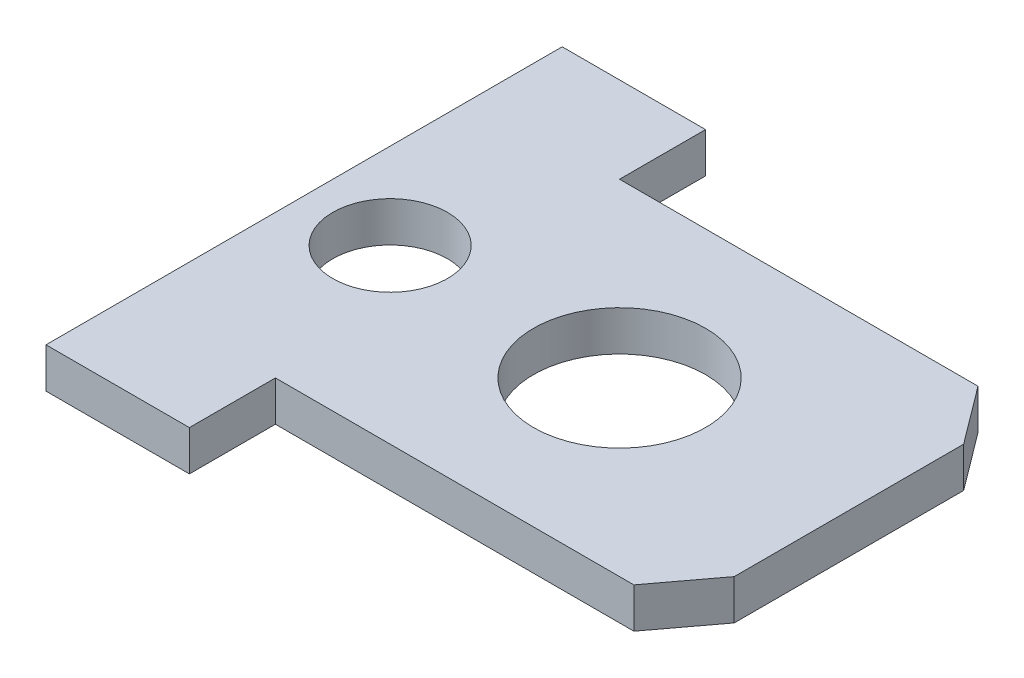
ISO-10303-21;
HEADER;
FILE_DESCRIPTION(('STEP AP214'),'2;1');
FILE_NAME('part.step','',(''),(''),'','','');
FILE_SCHEMA(('AUTOMOTIVE_DESIGN { 1 0 10303 214 1 1 1 1 }'));
ENDSEC;
DATA;
#1=APPLICATION_CONTEXT('core data for automotive mechanical design processes');
#2=APPLICATION_PROTOCOL_DEFINITION('international standard','automotive_design',2000,#1);
#3=PRODUCT_CONTEXT('',#1,'mechanical');
#4=PRODUCT('Part','Part','',(#3));
#5=PRODUCT_RELATED_PRODUCT_CATEGORY('part','',(#4));
#6=PRODUCT_DEFINITION_FORMATION('','',#4);
#7=PRODUCT_DEFINITION_CONTEXT('part definition',#1,'design');
#8=PRODUCT_DEFINITION('design','',#6,#7);
#9=PRODUCT_DEFINITION_SHAPE('','',#8);
#10=(LENGTH_UNIT() NAMED_UNIT(*) SI_UNIT(.MILLI.,.METRE.));
#11=(NAMED_UNIT(*) PLANE_ANGLE_UNIT() SI_UNIT($,.RADIAN.));
#12=(NAMED_UNIT(*) SI_UNIT($,.STERADIAN.) SOLID_ANGLE_UNIT());
#13=UNCERTAINTY_MEASURE_WITH_UNIT(LENGTH_MEASURE(1.E-05),#10,'distance_accuracy_value','');
#14=(GEOMETRIC_REPRESENTATION_CONTEXT(3) GLOBAL_UNCERTAINTY_ASSIGNED_CONTEXT((#13)) GLOBAL_UNIT_ASSIGNED_CONTEXT((#10,
#11,#12)) REPRESENTATION_CONTEXT('',''));
#15=CARTESIAN_POINT('',(0.,0.,0.));
#16=DIRECTION('',(0.,0.,1.));
#17=DIRECTION('',(1.,0.,0.));
#18=AXIS2_PLACEMENT_3D('',#15,#16,#17);
#19=CARTESIAN_POINT('',(16.,91.15,112.5));
#20=DIRECTION('',(0.,-1.,0.));
#21=DIRECTION('',(0.,0.,-1.));
#22=AXIS2_PLACEMENT_3D('',#19,#20,#21);
#23=PLANE('',#22);
#24=CARTESIAN_POINT('',(21.5,91.15,112.5));
#25=DIRECTION('',(0.,-1.,0.));
#26=DIRECTION('',(0.,0.,-1.));
#27=AXIS2_PLACEMENT_3D('',#24,#25,#26);
#28=CIRCLE('',#27,1.5);
#29=CARTESIAN_POINT('',(21.5,91.15,111.));
#30=VERTEX_POINT('',#29);
#31=EDGE_CURVE('E121',#30,#30,#28,.F.);
#32=ORIENTED_EDGE('',*,*,#31,.T.);
#33=EDGE_LOOP('',(#32));
#34=FACE_BOUND('',#33,.T.);
#35=CARTESIAN_POINT('',(17.5,91.15,112.5));
#36=DIRECTION('',(0.,-1.,0.));
#37=DIRECTION('',(0.,0.,-1.));
#38=AXIS2_PLACEMENT_3D('',#35,#36,#37);
#39=CIRCLE('',#38,1.);
#40=CARTESIAN_POINT('',(17.5,91.15,111.5));
#41=VERTEX_POINT('',#40);
#42=EDGE_CURVE('E20',#41,#41,#39,.F.);
#43=ORIENTED_EDGE('',*,*,#42,.T.);
#44=EDGE_LOOP('',(#43));
#45=FACE_BOUND('',#44,.T.);
#46=DIRECTION('',(-1.,0.,0.));
#47=VECTOR('',#46,1.);
#48=CARTESIAN_POINT('',(16.,91.15,108.));
#49=LINE('',#48,#47);
#50=CARTESIAN_POINT('',(18.5,91.15,108.));
#51=VERTEX_POINT('',#50);
#52=CARTESIAN_POINT('',(16.,91.15,108.));
#53=VERTEX_POINT('',#52);
#54=EDGE_CURVE('E152',#51,#53,#49,.T.);
#55=ORIENTED_EDGE('',*,*,#54,.F.);
#56=DIRECTION('',(0.,0.,-1.));
#57=VECTOR('',#56,1.);
#58=CARTESIAN_POINT('',(18.5,91.15,112.));
#59=LINE('',#58,#57);
#60=CARTESIAN_POINT('',(18.5,91.15,109.5));
#61=VERTEX_POINT('',#60);
#62=EDGE_CURVE('E157',#61,#51,#59,.T.);
#63=ORIENTED_EDGE('',*,*,#62,.F.);
#64=DIRECTION('',(-1.,0.,0.));
#65=VECTOR('',#64,1.);
#66=CARTESIAN_POINT('',(16.,91.15,109.5));
#67=LINE('',#66,#65);
#68=CARTESIAN_POINT('',(24.75,91.15,109.5));
#69=VERTEX_POINT('',#68);
#70=EDGE_CURVE('E162',#69,#61,#67,.T.);
#71=ORIENTED_EDGE('',*,*,#70,.F.);
#72=DIRECTION('',(-0.6,0.,-0.8));
#73=VECTOR('',#72,1.);
#74=CARTESIAN_POINT('',(25.125,91.15,110.));
#75=LINE('',#74,#73);
#76=CARTESIAN_POINT('',(25.5,91.15,110.5));
#77=VERTEX_POINT('',#76);
#78=EDGE_CURVE('E108',#77,#69,#75,.T.);
#79=ORIENTED_EDGE('',*,*,#78,.F.);
#80=DIRECTION('',(0.,0.,-1.));
#81=VECTOR('',#80,1.);
#82=CARTESIAN_POINT('',(25.5,91.15,112.));
#83=LINE('',#82,#81);
#84=CARTESIAN_POINT('',(25.5,91.15,114.5));
#85=VERTEX_POINT('',#84);
#86=EDGE_CURVE('E91',#85,#77,#83,.T.);
#87=ORIENTED_EDGE('',*,*,#86,.F.);
#88=DIRECTION('',(0.6,0.,-0.8));
#89=VECTOR('',#88,1.);
#90=CARTESIAN_POINT('',(25.125,91.15,115.));
#91=LINE('',#90,#89);
#92=CARTESIAN_POINT('',(24.75,91.15,115.5));
#93=VERTEX_POINT('',#92);
#94=EDGE_CURVE('E96',#93,#85,#91,.T.);
#95=ORIENTED_EDGE('',*,*,#94,.F.);
#96=DIRECTION('',(1.,0.,0.));
#97=VECTOR('',#96,1.);
#98=CARTESIAN_POINT('',(16.,91.15,115.5));
#99=LINE('',#98,#97);
#100=CARTESIAN_POINT('',(18.5,91.15,115.5));
#101=VERTEX_POINT('',#100);
#102=EDGE_CURVE('E128',#101,#93,#99,.T.);
#103=ORIENTED_EDGE('',*,*,#102,.F.);
#104=DIRECTION('',(0.,0.,-1.));
#105=VECTOR('',#104,1.);
#106=CARTESIAN_POINT('',(18.5,91.15,112.));
#107=LINE('',#106,#105);
#108=CARTESIAN_POINT('',(18.5,91.15,117.));
#109=VERTEX_POINT('',#108);
#110=EDGE_CURVE('E137',#109,#101,#107,.T.);
#111=ORIENTED_EDGE('',*,*,#110,.F.);
#112=DIRECTION('',(1.,0.,0.));
#113=VECTOR('',#112,1.);
#114=CARTESIAN_POINT('',(16.,91.15,117.));
#115=LINE('',#114,#113);
#116=CARTESIAN_POINT('',(16.,91.15,117.));
#117=VERTEX_POINT('',#116);
#118=EDGE_CURVE('E142',#117,#109,#115,.T.);
#119=ORIENTED_EDGE('',*,*,#118,.F.);
#120=DIRECTION('',(0.,0.,-1.));
#121=VECTOR('',#120,1.);
#122=CARTESIAN_POINT('',(16.,91.15,112.));
#123=LINE('',#122,#121);
#124=EDGE_CURVE('E147',#117,#53,#123,.T.);
#125=ORIENTED_EDGE('',*,*,#124,.T.);
#126=EDGE_LOOP('',(#55,#63,#71,#79,#87,#95,#103,#111,#119,#125));
#127=FACE_BOUND('',#126,.T.);
#128=ADVANCED_FACE('F17',(#34,#45,#127),#23,.T.);
#129=CARTESIAN_POINT('',(25.125,91.15,115.));
#130=DIRECTION('',(0.8,0.,0.6));
#131=DIRECTION('',(0.6,0.,-0.8));
#132=AXIS2_PLACEMENT_3D('',#129,#130,#131);
#133=PLANE('',#132);
#134=ORIENTED_EDGE('',*,*,#94,.T.);
#135=DIRECTION('',(0.,1.,0.));
#136=VECTOR('',#135,1.);
#137=CARTESIAN_POINT('',(25.5,91.5,114.5));
#138=LINE('',#137,#136);
#139=CARTESIAN_POINT('',(25.5,91.85,114.5));
#140=VERTEX_POINT('',#139);
#141=EDGE_CURVE('E98',#140,#85,#138,.F.);
#142=ORIENTED_EDGE('',*,*,#141,.F.);
#143=DIRECTION('',(0.6,0.,-0.8));
#144=VECTOR('',#143,1.);
#145=CARTESIAN_POINT('',(24.75,91.85,115.5));
#146=LINE('',#145,#144);
#147=CARTESIAN_POINT('',(24.75,91.85,115.5));
#148=VERTEX_POINT('',#147);
#149=EDGE_CURVE('E123',#148,#140,#146,.T.);
#150=ORIENTED_EDGE('',*,*,#149,.F.);
#151=DIRECTION('',(0.,1.,0.));
#152=VECTOR('',#151,1.);
#153=CARTESIAN_POINT('',(24.75,91.5,115.5));
#154=LINE('',#153,#152);
#155=EDGE_CURVE('E101',#93,#148,#154,.T.);
#156=ORIENTED_EDGE('',*,*,#155,.F.);
#157=EDGE_LOOP('',(#134,#142,#150,#156));
#158=FACE_BOUND('',#157,.T.);
#159=ADVANCED_FACE('F97',(#158),#133,.T.);
#160=CARTESIAN_POINT('',(25.5,91.5,112.));
#161=DIRECTION('',(1.,0.,0.));
#162=DIRECTION('',(0.,0.,-1.));
#163=AXIS2_PLACEMENT_3D('',#160,#161,#162);
#164=PLANE('',#163);
#165=ORIENTED_EDGE('',*,*,#141,.T.);
#166=ORIENTED_EDGE('',*,*,#86,.T.);
#167=DIRECTION('',(0.,1.,0.));
#168=VECTOR('',#167,1.);
#169=CARTESIAN_POINT('',(25.5,91.15,110.5));
#170=LINE('',#169,#168);
#171=CARTESIAN_POINT('',(25.5,91.85,110.5));
#172=VERTEX_POINT('',#171);
#173=EDGE_CURVE('E110',#172,#77,#170,.F.);
#174=ORIENTED_EDGE('',*,*,#173,.F.);
#175=DIRECTION('',(0.,0.,1.));
#176=VECTOR('',#175,1.);
#177=CARTESIAN_POINT('',(25.5,91.85,112.5));
#178=LINE('',#177,#176);
#179=EDGE_CURVE('E114',#140,#172,#178,.F.);
#180=ORIENTED_EDGE('',*,*,#179,.F.);
#181=EDGE_LOOP('',(#165,#166,#174,#180));
#182=FACE_BOUND('',#181,.T.);
#183=ADVANCED_FACE('F112',(#182),#164,.T.);
#184=CARTESIAN_POINT('',(25.125,91.15,110.));
#185=DIRECTION('',(0.8,0.,-0.6));
#186=DIRECTION('',(-0.6,0.,-0.8));
#187=AXIS2_PLACEMENT_3D('',#184,#185,#186);
#188=PLANE('',#187);
#189=ORIENTED_EDGE('',*,*,#78,.T.);
#190=DIRECTION('',(0.,1.,0.));
#191=VECTOR('',#190,1.);
#192=CARTESIAN_POINT('',(24.75,91.5,109.5));
#193=LINE('',#192,#191);
#194=CARTESIAN_POINT('',(24.75,91.85,109.5));
#195=VERTEX_POINT('',#194);
#196=EDGE_CURVE('E164',#195,#69,#193,.F.);
#197=ORIENTED_EDGE('',*,*,#196,.F.);
#198=DIRECTION('',(-0.6,0.,-0.8));
#199=VECTOR('',#198,1.);
#200=CARTESIAN_POINT('',(25.5,91.85,110.5));
#201=LINE('',#200,#199);
#202=EDGE_CURVE('E171',#172,#195,#201,.T.);
#203=ORIENTED_EDGE('',*,*,#202,.F.);
#204=ORIENTED_EDGE('',*,*,#173,.T.);
#205=EDGE_LOOP('',(#189,#197,#203,#204));
#206=FACE_BOUND('',#205,.T.);
#207=ADVANCED_FACE('F169',(#206),#188,.T.);
#208=CARTESIAN_POINT('',(16.,91.5,109.5));
#209=DIRECTION('',(0.,0.,-1.));
#210=DIRECTION('',(-1.,0.,0.));
#211=AXIS2_PLACEMENT_3D('',#208,#209,#210);
#212=PLANE('',#211);
#213=ORIENTED_EDGE('',*,*,#70,.T.);
#214=DIRECTION('',(0.,1.,0.));
#215=VECTOR('',#214,1.);
#216=CARTESIAN_POINT('',(18.5,91.5,109.5));
#217=LINE('',#216,#215);
#218=CARTESIAN_POINT('',(18.5,91.85,109.5));
#219=VERTEX_POINT('',#218);
#220=EDGE_CURVE('E159',#219,#61,#217,.F.);
#221=ORIENTED_EDGE('',*,*,#220,.F.);
#222=DIRECTION('',(1.,0.,0.));
#223=VECTOR('',#222,1.);
#224=CARTESIAN_POINT('',(16.,91.85,109.5));
#225=LINE('',#224,#223);
#226=EDGE_CURVE('E175',#195,#219,#225,.F.);
#227=ORIENTED_EDGE('',*,*,#226,.F.);
#228=ORIENTED_EDGE('',*,*,#196,.T.);
#229=EDGE_LOOP('',(#213,#221,#227,#228));
#230=FACE_BOUND('',#229,.T.);
#231=ADVANCED_FACE('F284',(#230),#212,.T.);
#232=CARTESIAN_POINT('',(18.5,91.5,112.));
#233=DIRECTION('',(1.,0.,0.));
#234=DIRECTION('',(0.,0.,-1.));
#235=AXIS2_PLACEMENT_3D('',#232,#233,#234);
#236=PLANE('',#235);
#237=ORIENTED_EDGE('',*,*,#220,.T.);
#238=ORIENTED_EDGE('',*,*,#62,.T.);
#239=DIRECTION('',(0.,1.,0.));
#240=VECTOR('',#239,1.);
#241=CARTESIAN_POINT('',(18.5,91.5,108.));
#242=LINE('',#241,#240);
#243=CARTESIAN_POINT('',(18.5,91.85,108.));
#244=VERTEX_POINT('',#243);
#245=EDGE_CURVE('E154',#244,#51,#242,.F.);
#246=ORIENTED_EDGE('',*,*,#245,.F.);
#247=DIRECTION('',(0.,0.,1.));
#248=VECTOR('',#247,1.);
#249=CARTESIAN_POINT('',(18.5,91.85,112.5));
#250=LINE('',#249,#248);
#251=EDGE_CURVE('E182',#219,#244,#250,.F.);
#252=ORIENTED_EDGE('',*,*,#251,.F.);
#253=EDGE_LOOP('',(#237,#238,#246,#252));
#254=FACE_BOUND('',#253,.T.);
#255=ADVANCED_FACE('F274',(#254),#236,.T.);
#256=CARTESIAN_POINT('',(16.,91.5,108.));
#257=DIRECTION('',(0.,0.,-1.));
#258=DIRECTION('',(-1.,0.,0.));
#259=AXIS2_PLACEMENT_3D('',#256,#257,#258);
#260=PLANE('',#259);
#261=ORIENTED_EDGE('',*,*,#245,.T.);
#262=ORIENTED_EDGE('',*,*,#54,.T.);
#263=DIRECTION('',(0.,1.,0.));
#264=VECTOR('',#263,1.);
#265=CARTESIAN_POINT('',(16.,91.5,108.));
#266=LINE('',#265,#264);
#267=CARTESIAN_POINT('',(16.,91.85,108.));
#268=VERTEX_POINT('',#267);
#269=EDGE_CURVE('E150',#53,#268,#266,.T.);
#270=ORIENTED_EDGE('',*,*,#269,.T.);
#271=DIRECTION('',(1.,0.,0.));
#272=VECTOR('',#271,1.);
#273=CARTESIAN_POINT('',(16.,91.85,108.));
#274=LINE('',#273,#272);
#275=EDGE_CURVE('E185',#244,#268,#274,.F.);
#276=ORIENTED_EDGE('',*,*,#275,.F.);
#277=EDGE_LOOP('',(#261,#262,#270,#276));
#278=FACE_BOUND('',#277,.T.);
#279=ADVANCED_FACE('F264',(#278),#260,.T.);
#280=CARTESIAN_POINT('',(16.,91.5,112.));
#281=DIRECTION('',(1.,0.,0.));
#282=DIRECTION('',(0.,0.,-1.));
#283=AXIS2_PLACEMENT_3D('',#280,#281,#282);
#284=PLANE('',#283);
#285=DIRECTION('',(0.,1.,0.));
#286=VECTOR('',#285,1.);
#287=CARTESIAN_POINT('',(16.,91.5,117.));
#288=LINE('',#287,#286);
#289=CARTESIAN_POINT('',(16.,91.85,117.));
#290=VERTEX_POINT('',#289);
#291=EDGE_CURVE('E144',#290,#117,#288,.F.);
#292=ORIENTED_EDGE('',*,*,#291,.F.);
#293=DIRECTION('',(0.,0.,1.));
#294=VECTOR('',#293,1.);
#295=CARTESIAN_POINT('',(16.,91.85,112.5));
#296=LINE('',#295,#294);
#297=EDGE_CURVE('E188',#268,#290,#296,.T.);
#298=ORIENTED_EDGE('',*,*,#297,.F.);
#299=ORIENTED_EDGE('',*,*,#269,.F.);
#300=ORIENTED_EDGE('',*,*,#124,.F.);
#301=EDGE_LOOP('',(#292,#298,#299,#300));
#302=FACE_BOUND('',#301,.T.);
#303=ADVANCED_FACE('F254',(#302),#284,.F.);
#304=CARTESIAN_POINT('',(16.,91.5,117.));
#305=DIRECTION('',(0.,0.,1.));
#306=DIRECTION('',(1.,0.,0.));
#307=AXIS2_PLACEMENT_3D('',#304,#305,#306);
#308=PLANE('',#307);
#309=ORIENTED_EDGE('',*,*,#291,.T.);
#310=ORIENTED_EDGE('',*,*,#118,.T.);
#311=DIRECTION('',(0.,1.,0.));
#312=VECTOR('',#311,1.);
#313=CARTESIAN_POINT('',(18.5,91.5,117.));
#314=LINE('',#313,#312);
#315=CARTESIAN_POINT('',(18.5,91.85,117.));
#316=VERTEX_POINT('',#315);
#317=EDGE_CURVE('E139',#316,#109,#314,.F.);
#318=ORIENTED_EDGE('',*,*,#317,.F.);
#319=DIRECTION('',(1.,0.,0.));
#320=VECTOR('',#319,1.);
#321=CARTESIAN_POINT('',(16.,91.85,117.));
#322=LINE('',#321,#320);
#323=EDGE_CURVE('E191',#290,#316,#322,.T.);
#324=ORIENTED_EDGE('',*,*,#323,.F.);
#325=EDGE_LOOP('',(#309,#310,#318,#324));
#326=FACE_BOUND('',#325,.T.);
#327=ADVANCED_FACE('F209',(#326),#308,.T.);
#328=CARTESIAN_POINT('',(18.5,91.5,112.));
#329=DIRECTION('',(1.,0.,0.));
#330=DIRECTION('',(0.,0.,-1.));
#331=AXIS2_PLACEMENT_3D('',#328,#329,#330);
#332=PLANE('',#331);
#333=ORIENTED_EDGE('',*,*,#110,.T.);
#334=DIRECTION('',(0.,1.,0.));
#335=VECTOR('',#334,1.);
#336=CARTESIAN_POINT('',(18.5,91.5,115.5));
#337=LINE('',#336,#335);
#338=CARTESIAN_POINT('',(18.5,91.85,115.5));
#339=VERTEX_POINT('',#338);
#340=EDGE_CURVE('E35',#339,#101,#337,.F.);
#341=ORIENTED_EDGE('',*,*,#340,.F.);
#342=DIRECTION('',(0.,0.,1.));
#343=VECTOR('',#342,1.);
#344=CARTESIAN_POINT('',(18.5,91.85,112.5));
#345=LINE('',#344,#343);
#346=EDGE_CURVE('E194',#316,#339,#345,.F.);
#347=ORIENTED_EDGE('',*,*,#346,.F.);
#348=ORIENTED_EDGE('',*,*,#317,.T.);
#349=EDGE_LOOP('',(#333,#341,#347,#348));
#350=FACE_BOUND('',#349,.T.);
#351=ADVANCED_FACE('F199',(#350),#332,.T.);
#352=CARTESIAN_POINT('',(16.,91.5,115.5));
#353=DIRECTION('',(0.,0.,1.));
#354=DIRECTION('',(1.,0.,0.));
#355=AXIS2_PLACEMENT_3D('',#352,#353,#354);
#356=PLANE('',#355);
#357=ORIENTED_EDGE('',*,*,#340,.T.);
#358=ORIENTED_EDGE('',*,*,#102,.T.);
#359=ORIENTED_EDGE('',*,*,#155,.T.);
#360=DIRECTION('',(1.,0.,0.));
#361=VECTOR('',#360,1.);
#362=CARTESIAN_POINT('',(16.,91.85,115.5));
#363=LINE('',#362,#361);
#364=EDGE_CURVE('E120',#339,#148,#363,.T.);
#365=ORIENTED_EDGE('',*,*,#364,.F.);
#366=EDGE_LOOP('',(#357,#358,#359,#365));
#367=FACE_BOUND('',#366,.T.);
#368=ADVANCED_FACE('F196',(#367),#356,.T.);
#369=CARTESIAN_POINT('',(17.5,91.15,112.5));
#370=DIRECTION('',(0.,-1.,0.));
#371=DIRECTION('',(0.,0.,-1.));
#372=AXIS2_PLACEMENT_3D('',#369,#370,#371);
#373=CYLINDRICAL_SURFACE('',#372,1.);
#374=ORIENTED_EDGE('',*,*,#42,.F.);
#375=EDGE_LOOP('',(#374));
#376=FACE_BOUND('',#375,.T.);
#377=CARTESIAN_POINT('',(17.5,91.85,112.5));
#378=DIRECTION('',(0.,-1.,0.));
#379=DIRECTION('',(0.,0.,-1.));
#380=AXIS2_PLACEMENT_3D('',#377,#378,#379);
#381=CIRCLE('',#380,1.);
#382=CARTESIAN_POINT('',(17.5,91.85,111.5));
#383=VERTEX_POINT('',#382);
#384=EDGE_CURVE('E26',#383,#383,#381,.T.);
#385=ORIENTED_EDGE('',*,*,#384,.F.);
#386=EDGE_LOOP('',(#385));
#387=FACE_BOUND('',#386,.T.);
#388=ADVANCED_FACE('F198',(#376,#387),#373,.F.);
#389=CARTESIAN_POINT('',(21.5,91.15,112.5));
#390=DIRECTION('',(0.,-1.,0.));
#391=DIRECTION('',(0.,0.,-1.));
#392=AXIS2_PLACEMENT_3D('',#389,#390,#391);
#393=CYLINDRICAL_SURFACE('',#392,1.5);
#394=ORIENTED_EDGE('',*,*,#31,.F.);
#395=EDGE_LOOP('',(#394));
#396=FACE_BOUND('',#395,.T.);
#397=CARTESIAN_POINT('',(21.5,91.85,112.5));
#398=DIRECTION('',(0.,-1.,0.));
#399=DIRECTION('',(0.,0.,-1.));
#400=AXIS2_PLACEMENT_3D('',#397,#398,#399);
#401=CIRCLE('',#400,1.5);
#402=CARTESIAN_POINT('',(21.5,91.85,111.));
#403=VERTEX_POINT('',#402);
#404=EDGE_CURVE('E11',#403,#403,#401,.T.);
#405=ORIENTED_EDGE('',*,*,#404,.F.);
#406=EDGE_LOOP('',(#405));
#407=FACE_BOUND('',#406,.T.);
#408=ADVANCED_FACE('F206',(#396,#407),#393,.F.);
#409=CARTESIAN_POINT('',(16.,91.85,112.5));
#410=DIRECTION('',(0.,1.,0.));
#411=DIRECTION('',(0.,0.,1.));
#412=AXIS2_PLACEMENT_3D('',#409,#410,#411);
#413=PLANE('',#412);
#414=ORIENTED_EDGE('',*,*,#404,.T.);
#415=EDGE_LOOP('',(#414));
#416=FACE_BOUND('',#415,.T.);
#417=ORIENTED_EDGE('',*,*,#384,.T.);
#418=EDGE_LOOP('',(#417));
#419=FACE_BOUND('',#418,.T.);
#420=ORIENTED_EDGE('',*,*,#346,.T.);
#421=ORIENTED_EDGE('',*,*,#364,.T.);
#422=ORIENTED_EDGE('',*,*,#149,.T.);
#423=ORIENTED_EDGE('',*,*,#179,.T.);
#424=ORIENTED_EDGE('',*,*,#202,.T.);
#425=ORIENTED_EDGE('',*,*,#226,.T.);
#426=ORIENTED_EDGE('',*,*,#251,.T.);
#427=ORIENTED_EDGE('',*,*,#275,.T.);
#428=ORIENTED_EDGE('',*,*,#297,.T.);
#429=ORIENTED_EDGE('',*,*,#323,.T.);
#430=EDGE_LOOP('',(#420,#421,#422,#423,#424,#425,#426,#427,#428,#429));
#431=FACE_BOUND('',#430,.T.);
#432=ADVANCED_FACE('F178',(#416,#419,#431),#413,.T.);
#433=CLOSED_SHELL('',(#128,#159,#183,#207,#231,#255,#279,#303,#327,#351,#368,#388,#408,#432));
#434=MANIFOLD_SOLID_BREP('B1',#433);
#435=ADVANCED_BREP_SHAPE_REPRESENTATION('',(#18,#434),#14);
#436=SHAPE_DEFINITION_REPRESENTATION(#9,#435);
ENDSEC;
END-ISO-10303-21;
